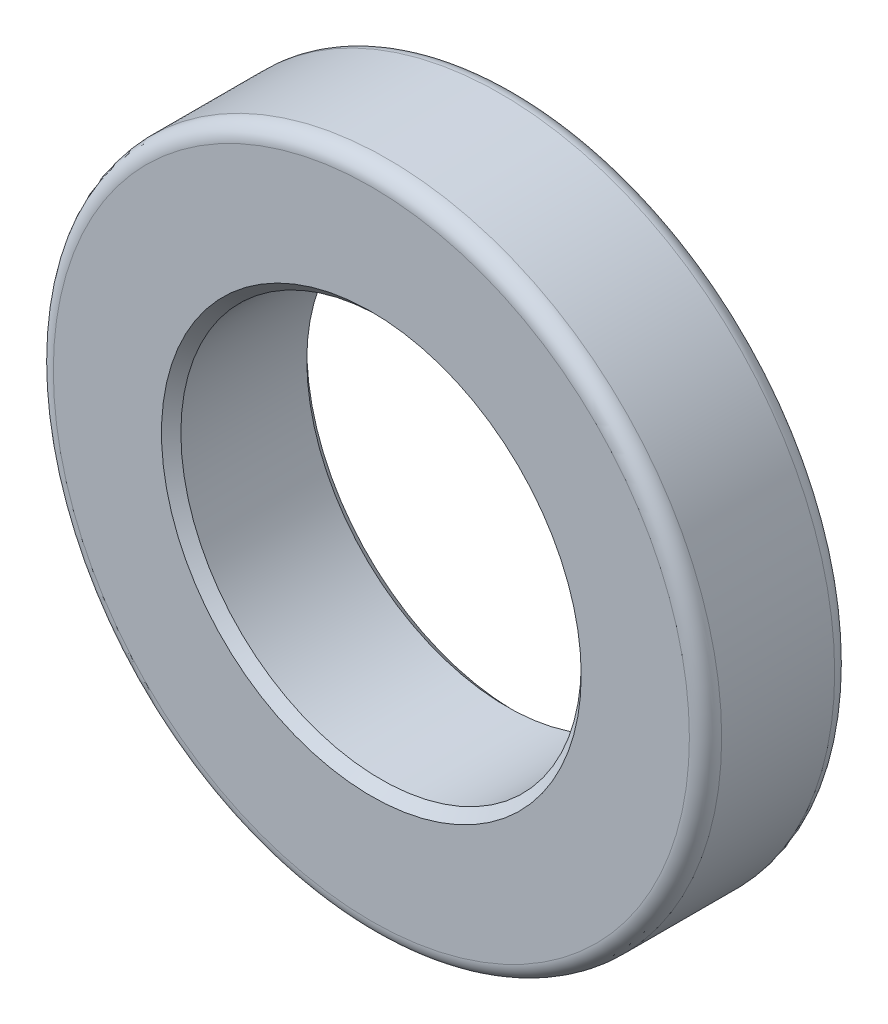
ISO-10303-21;
HEADER;
FILE_DESCRIPTION(('STEP AP214'),'2;1');
FILE_NAME('part.step','',(''),(''),'','','');
FILE_SCHEMA(('AUTOMOTIVE_DESIGN { 1 0 10303 214 1 1 1 1 }'));
ENDSEC;
DATA;
#1=APPLICATION_CONTEXT('core data for automotive mechanical design processes');
#2=APPLICATION_PROTOCOL_DEFINITION('international standard','automotive_design',2000,#1);
#3=PRODUCT_CONTEXT('',#1,'mechanical');
#4=PRODUCT('Part','Part','',(#3));
#5=PRODUCT_RELATED_PRODUCT_CATEGORY('part','',(#4));
#6=PRODUCT_DEFINITION_FORMATION('','',#4);
#7=PRODUCT_DEFINITION_CONTEXT('part definition',#1,'design');
#8=PRODUCT_DEFINITION('design','',#6,#7);
#9=PRODUCT_DEFINITION_SHAPE('','',#8);
#10=(LENGTH_UNIT() NAMED_UNIT(*) SI_UNIT(.MILLI.,.METRE.));
#11=(NAMED_UNIT(*) PLANE_ANGLE_UNIT() SI_UNIT($,.RADIAN.));
#12=(NAMED_UNIT(*) SI_UNIT($,.STERADIAN.) SOLID_ANGLE_UNIT());
#13=UNCERTAINTY_MEASURE_WITH_UNIT(LENGTH_MEASURE(1.E-05),#10,'distance_accuracy_value','');
#14=(GEOMETRIC_REPRESENTATION_CONTEXT(3) GLOBAL_UNCERTAINTY_ASSIGNED_CONTEXT((#13)) GLOBAL_UNIT_ASSIGNED_CONTEXT((#10,
#11,#12)) REPRESENTATION_CONTEXT('',''));
#15=CARTESIAN_POINT('',(0.,0.,0.));
#16=DIRECTION('',(0.,0.,1.));
#17=DIRECTION('',(1.,0.,0.));
#18=AXIS2_PLACEMENT_3D('',#15,#16,#17);
#19=CARTESIAN_POINT('',(0.,0.,1.143));
#20=DIRECTION('',(0.,0.,1.));
#21=DIRECTION('',(1.,0.,0.));
#22=AXIS2_PLACEMENT_3D('',#19,#20,#21);
#23=PLANE('',#22);
#24=CARTESIAN_POINT('',(0.,0.,1.143));
#25=DIRECTION('',(0.,0.,1.));
#26=DIRECTION('',(1.,0.,0.));
#27=AXIS2_PLACEMENT_3D('',#24,#25,#26);
#28=CIRCLE('',#27,1.651);
#29=CARTESIAN_POINT('',(1.651,0.,1.143));
#30=VERTEX_POINT('',#29);
#31=EDGE_CURVE('E10',#30,#30,#28,.F.);
#32=ORIENTED_EDGE('',*,*,#31,.T.);
#33=EDGE_LOOP('',(#32));
#34=FACE_BOUND('',#33,.T.);
#35=CARTESIAN_POINT('',(0.,0.,1.143));
#36=DIRECTION('',(0.,0.,1.));
#37=DIRECTION('',(1.,0.,0.));
#38=AXIS2_PLACEMENT_3D('',#35,#36,#37);
#39=CIRCLE('',#38,2.5019);
#40=CARTESIAN_POINT('',(2.5019,0.,1.143));
#41=VERTEX_POINT('',#40);
#42=EDGE_CURVE('E52',#41,#41,#39,.T.);
#43=ORIENTED_EDGE('',*,*,#42,.T.);
#44=EDGE_LOOP('',(#43));
#45=FACE_BOUND('',#44,.T.);
#46=ADVANCED_FACE('F32',(#34,#45),#23,.T.);
#47=CARTESIAN_POINT('',(0.,0.,0.));
#48=DIRECTION('',(0.,0.,1.));
#49=DIRECTION('',(1.,0.,0.));
#50=AXIS2_PLACEMENT_3D('',#47,#48,#49);
#51=PLANE('',#50);
#52=CARTESIAN_POINT('',(0.,0.,0.));
#53=DIRECTION('',(0.,0.,1.));
#54=DIRECTION('',(1.,0.,0.));
#55=AXIS2_PLACEMENT_3D('',#52,#53,#54);
#56=CIRCLE('',#55,1.651);
#57=CARTESIAN_POINT('',(1.651,0.,0.));
#58=VERTEX_POINT('',#57);
#59=EDGE_CURVE('E47',#58,#58,#56,.T.);
#60=ORIENTED_EDGE('',*,*,#59,.T.);
#61=EDGE_LOOP('',(#60));
#62=FACE_BOUND('',#61,.T.);
#63=CARTESIAN_POINT('',(0.,0.,0.));
#64=DIRECTION('',(0.,0.,1.));
#65=DIRECTION('',(1.,0.,0.));
#66=AXIS2_PLACEMENT_3D('',#63,#64,#65);
#67=CIRCLE('',#66,2.5019);
#68=CARTESIAN_POINT('',(2.5019,0.,0.));
#69=VERTEX_POINT('',#68);
#70=EDGE_CURVE('E55',#69,#69,#67,.F.);
#71=ORIENTED_EDGE('',*,*,#70,.T.);
#72=EDGE_LOOP('',(#71));
#73=FACE_BOUND('',#72,.T.);
#74=ADVANCED_FACE('F76',(#62,#73),#51,.F.);
#75=CARTESIAN_POINT('',(0.,0.,1.143));
#76=DIRECTION('',(0.,0.,-1.));
#77=DIRECTION('',(-1.,0.,0.));
#78=AXIS2_PLACEMENT_3D('',#75,#76,#77);
#79=CYLINDRICAL_SURFACE('',#78,2.6289);
#80=CARTESIAN_POINT('',(0.,0.,0.127));
#81=DIRECTION('',(0.,0.,1.));
#82=DIRECTION('',(1.,0.,0.));
#83=AXIS2_PLACEMENT_3D('',#80,#81,#82);
#84=CIRCLE('',#83,2.6289);
#85=CARTESIAN_POINT('',(2.6289,0.,0.127));
#86=VERTEX_POINT('',#85);
#87=EDGE_CURVE('E58',#86,#86,#84,.T.);
#88=ORIENTED_EDGE('',*,*,#87,.T.);
#89=EDGE_LOOP('',(#88));
#90=FACE_BOUND('',#89,.T.);
#91=CARTESIAN_POINT('',(0.,0.,1.016));
#92=DIRECTION('',(0.,0.,1.));
#93=DIRECTION('',(1.,0.,0.));
#94=AXIS2_PLACEMENT_3D('',#91,#92,#93);
#95=CIRCLE('',#94,2.6289);
#96=CARTESIAN_POINT('',(2.6289,0.,1.016));
#97=VERTEX_POINT('',#96);
#98=EDGE_CURVE('E61',#97,#97,#95,.F.);
#99=ORIENTED_EDGE('',*,*,#98,.T.);
#100=EDGE_LOOP('',(#99));
#101=FACE_BOUND('',#100,.T.);
#102=ADVANCED_FACE('F65',(#90,#101),#79,.T.);
#103=CARTESIAN_POINT('',(0.,0.,1.143));
#104=DIRECTION('',(0.,0.,-1.));
#105=DIRECTION('',(-1.,0.,0.));
#106=AXIS2_PLACEMENT_3D('',#103,#104,#105);
#107=CYLINDRICAL_SURFACE('',#106,1.5748);
#108=CARTESIAN_POINT('',(0.,0.,0.0762000000000007));
#109=DIRECTION('',(0.,0.,1.));
#110=DIRECTION('',(1.,0.,0.));
#111=AXIS2_PLACEMENT_3D('',#108,#109,#110);
#112=CIRCLE('',#111,1.5748);
#113=CARTESIAN_POINT('',(1.5748,0.,0.0762000000000007));
#114=VERTEX_POINT('',#113);
#115=EDGE_CURVE('E39',#114,#114,#112,.F.);
#116=ORIENTED_EDGE('',*,*,#115,.T.);
#117=EDGE_LOOP('',(#116));
#118=FACE_BOUND('',#117,.T.);
#119=CARTESIAN_POINT('',(0.,0.,1.0668));
#120=DIRECTION('',(0.,0.,1.));
#121=DIRECTION('',(1.,0.,0.));
#122=AXIS2_PLACEMENT_3D('',#119,#120,#121);
#123=CIRCLE('',#122,1.5748);
#124=CARTESIAN_POINT('',(1.5748,0.,1.0668));
#125=VERTEX_POINT('',#124);
#126=EDGE_CURVE('E43',#125,#125,#123,.T.);
#127=ORIENTED_EDGE('',*,*,#126,.T.);
#128=EDGE_LOOP('',(#127));
#129=FACE_BOUND('',#128,.T.);
#130=ADVANCED_FACE('F84',(#118,#129),#107,.F.);
#131=CARTESIAN_POINT('',(0.,0.,0.127));
#132=DIRECTION('',(0.,0.,1.));
#133=DIRECTION('',(1.,0.,0.));
#134=AXIS2_PLACEMENT_3D('',#131,#132,#133);
#135=TOROIDAL_SURFACE('',#134,2.5019,0.127);
#136=ORIENTED_EDGE('',*,*,#70,.F.);
#137=EDGE_LOOP('',(#136));
#138=FACE_BOUND('',#137,.T.);
#139=ORIENTED_EDGE('',*,*,#87,.F.);
#140=EDGE_LOOP('',(#139));
#141=FACE_BOUND('',#140,.T.);
#142=ADVANCED_FACE('F71',(#138,#141),#135,.T.);
#143=CARTESIAN_POINT('',(0.,0.,1.016));
#144=DIRECTION('',(0.,0.,1.));
#145=DIRECTION('',(1.,0.,0.));
#146=AXIS2_PLACEMENT_3D('',#143,#144,#145);
#147=TOROIDAL_SURFACE('',#146,2.5019,0.127);
#148=ORIENTED_EDGE('',*,*,#98,.F.);
#149=EDGE_LOOP('',(#148));
#150=FACE_BOUND('',#149,.T.);
#151=ORIENTED_EDGE('',*,*,#42,.F.);
#152=EDGE_LOOP('',(#151));
#153=FACE_BOUND('',#152,.T.);
#154=ADVANCED_FACE('F67',(#150,#153),#147,.T.);
#155=CARTESIAN_POINT('',(0.,0.,0.));
#156=DIRECTION('',(0.,0.,-1.));
#157=DIRECTION('',(-1.,0.,0.));
#158=AXIS2_PLACEMENT_3D('',#155,#156,#157);
#159=CONICAL_SURFACE('',#158,1.651,0.785398163397446);
#160=ORIENTED_EDGE('',*,*,#115,.F.);
#161=EDGE_LOOP('',(#160));
#162=FACE_BOUND('',#161,.T.);
#163=ORIENTED_EDGE('',*,*,#59,.F.);
#164=EDGE_LOOP('',(#163));
#165=FACE_BOUND('',#164,.T.);
#166=ADVANCED_FACE('F70',(#162,#165),#159,.F.);
#167=CARTESIAN_POINT('',(0.,0.,1.0668));
#168=DIRECTION('',(0.,0.,1.));
#169=DIRECTION('',(1.,0.,0.));
#170=AXIS2_PLACEMENT_3D('',#167,#168,#169);
#171=CONICAL_SURFACE('',#170,1.5748,0.785398163397448);
#172=ORIENTED_EDGE('',*,*,#31,.F.);
#173=EDGE_LOOP('',(#172));
#174=FACE_BOUND('',#173,.T.);
#175=ORIENTED_EDGE('',*,*,#126,.F.);
#176=EDGE_LOOP('',(#175));
#177=FACE_BOUND('',#176,.T.);
#178=ADVANCED_FACE('F34',(#174,#177),#171,.F.);
#179=CLOSED_SHELL('',(#46,#74,#102,#130,#142,#154,#166,#178));
#180=MANIFOLD_SOLID_BREP('B2',#179);
#181=ADVANCED_BREP_SHAPE_REPRESENTATION('',(#18,#180),#14);
#182=SHAPE_DEFINITION_REPRESENTATION(#9,#181);
ENDSEC;
END-ISO-10303-21;
